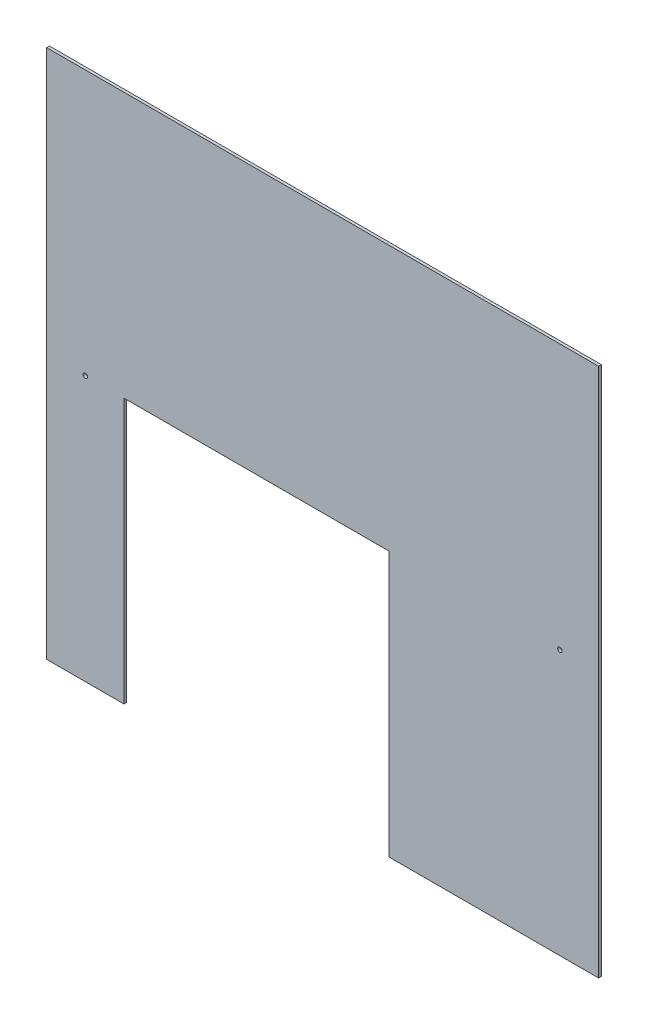
ISO-10303-21;
HEADER;
FILE_DESCRIPTION(('STEP AP214'),'2;1');
FILE_NAME('part.step','',(''),(''),'','','');
FILE_SCHEMA(('AUTOMOTIVE_DESIGN { 1 0 10303 214 1 1 1 1 }'));
ENDSEC;
DATA;
#1=APPLICATION_CONTEXT('core data for automotive mechanical design processes');
#2=APPLICATION_PROTOCOL_DEFINITION('international standard','automotive_design',2000,#1);
#3=PRODUCT_CONTEXT('',#1,'mechanical');
#4=PRODUCT('Part','Part','',(#3));
#5=PRODUCT_RELATED_PRODUCT_CATEGORY('part','',(#4));
#6=PRODUCT_DEFINITION_FORMATION('','',#4);
#7=PRODUCT_DEFINITION_CONTEXT('part definition',#1,'design');
#8=PRODUCT_DEFINITION('design','',#6,#7);
#9=PRODUCT_DEFINITION_SHAPE('','',#8);
#10=(LENGTH_UNIT() NAMED_UNIT(*) SI_UNIT(.MILLI.,.METRE.));
#11=(NAMED_UNIT(*) PLANE_ANGLE_UNIT() SI_UNIT($,.RADIAN.));
#12=(NAMED_UNIT(*) SI_UNIT($,.STERADIAN.) SOLID_ANGLE_UNIT());
#13=UNCERTAINTY_MEASURE_WITH_UNIT(LENGTH_MEASURE(1.E-05),#10,'distance_accuracy_value','');
#14=(GEOMETRIC_REPRESENTATION_CONTEXT(3) GLOBAL_UNCERTAINTY_ASSIGNED_CONTEXT((#13)) GLOBAL_UNIT_ASSIGNED_CONTEXT((#10,
#11,#12)) REPRESENTATION_CONTEXT('',''));
#15=CARTESIAN_POINT('',(0.,0.,0.));
#16=DIRECTION('',(0.,0.,1.));
#17=DIRECTION('',(1.,0.,0.));
#18=AXIS2_PLACEMENT_3D('',#15,#16,#17);
#19=CARTESIAN_POINT('',(-630.182303707183,-173.201114206128,3.175));
#20=DIRECTION('',(1.,0.,0.));
#21=DIRECTION('',(0.,0.,-1.));
#22=AXIS2_PLACEMENT_3D('',#19,#20,#21);
#23=PLANE('',#22);
#24=DIRECTION('',(0.,-1.,0.));
#25=VECTOR('',#24,1.);
#26=CARTESIAN_POINT('',(-630.182303707183,-173.201114206128,0.));
#27=LINE('',#26,#25);
#28=CARTESIAN_POINT('',(-630.182303707183,436.398885793872,0.));
#29=VERTEX_POINT('',#28);
#30=CARTESIAN_POINT('',(-630.182303707183,-173.201114206128,0.));
#31=VERTEX_POINT('',#30);
#32=EDGE_CURVE('E134',#29,#31,#27,.T.);
#33=ORIENTED_EDGE('',*,*,#32,.T.);
#34=DIRECTION('',(0.,0.,-1.));
#35=VECTOR('',#34,1.);
#36=CARTESIAN_POINT('',(-630.182303707183,-173.201114206128,3.175));
#37=LINE('',#36,#35);
#38=CARTESIAN_POINT('',(-630.182303707183,-173.201114206128,3.175));
#39=VERTEX_POINT('',#38);
#40=EDGE_CURVE('E11',#39,#31,#37,.T.);
#41=ORIENTED_EDGE('',*,*,#40,.F.);
#42=DIRECTION('',(0.,-1.,0.));
#43=VECTOR('',#42,1.);
#44=CARTESIAN_POINT('',(-630.182303707183,-173.201114206128,3.175));
#45=LINE('',#44,#43);
#46=CARTESIAN_POINT('',(-630.182303707183,436.398885793872,3.175));
#47=VERTEX_POINT('',#46);
#48=EDGE_CURVE('E149',#47,#39,#45,.T.);
#49=ORIENTED_EDGE('',*,*,#48,.F.);
#50=DIRECTION('',(0.,0.,-1.));
#51=VECTOR('',#50,1.);
#52=CARTESIAN_POINT('',(-630.182303707183,436.398885793872,3.175));
#53=LINE('',#52,#51);
#54=EDGE_CURVE('E130',#47,#29,#53,.T.);
#55=ORIENTED_EDGE('',*,*,#54,.T.);
#56=EDGE_LOOP('',(#33,#41,#49,#55));
#57=FACE_BOUND('',#56,.T.);
#58=ADVANCED_FACE('F38',(#57),#23,.F.);
#59=CARTESIAN_POINT('',(-630.182303707183,-173.201114206128,3.175));
#60=DIRECTION('',(0.,1.,0.));
#61=DIRECTION('',(0.,0.,1.));
#62=AXIS2_PLACEMENT_3D('',#59,#60,#61);
#63=PLANE('',#62);
#64=DIRECTION('',(1.,0.,0.));
#65=VECTOR('',#64,1.);
#66=CARTESIAN_POINT('',(-630.182303707183,-173.201114206128,0.));
#67=LINE('',#66,#65);
#68=CARTESIAN_POINT('',(-541.282303707183,-173.201114206128,0.));
#69=VERTEX_POINT('',#68);
#70=EDGE_CURVE('E137',#31,#69,#67,.T.);
#71=ORIENTED_EDGE('',*,*,#70,.T.);
#72=DIRECTION('',(0.,0.,-1.));
#73=VECTOR('',#72,1.);
#74=CARTESIAN_POINT('',(-541.282303707183,-173.201114206128,3.175));
#75=LINE('',#74,#73);
#76=CARTESIAN_POINT('',(-541.282303707183,-173.201114206128,3.175));
#77=VERTEX_POINT('',#76);
#78=EDGE_CURVE('E46',#77,#69,#75,.T.);
#79=ORIENTED_EDGE('',*,*,#78,.F.);
#80=DIRECTION('',(1.,0.,0.));
#81=VECTOR('',#80,1.);
#82=CARTESIAN_POINT('',(-630.182303707183,-173.201114206128,3.175));
#83=LINE('',#82,#81);
#84=EDGE_CURVE('E97',#39,#77,#83,.T.);
#85=ORIENTED_EDGE('',*,*,#84,.F.);
#86=ORIENTED_EDGE('',*,*,#40,.T.);
#87=EDGE_LOOP('',(#71,#79,#85,#86));
#88=FACE_BOUND('',#87,.T.);
#89=ADVANCED_FACE('F219',(#88),#63,.F.);
#90=CARTESIAN_POINT('',(-541.282303707183,-173.201114206128,3.175));
#91=DIRECTION('',(-1.,0.,0.));
#92=DIRECTION('',(0.,0.,1.));
#93=AXIS2_PLACEMENT_3D('',#90,#91,#92);
#94=PLANE('',#93);
#95=DIRECTION('',(0.,1.,0.));
#96=VECTOR('',#95,1.);
#97=CARTESIAN_POINT('',(-541.282303707183,-173.201114206128,0.));
#98=LINE('',#97,#96);
#99=CARTESIAN_POINT('',(-541.282303707183,131.598885793872,0.));
#100=VERTEX_POINT('',#99);
#101=EDGE_CURVE('E140',#69,#100,#98,.T.);
#102=ORIENTED_EDGE('',*,*,#101,.T.);
#103=DIRECTION('',(0.,0.,-1.));
#104=VECTOR('',#103,1.);
#105=CARTESIAN_POINT('',(-541.282303707183,131.598885793872,3.175));
#106=LINE('',#105,#104);
#107=CARTESIAN_POINT('',(-541.282303707183,131.598885793872,3.175));
#108=VERTEX_POINT('',#107);
#109=EDGE_CURVE('E156',#108,#100,#106,.T.);
#110=ORIENTED_EDGE('',*,*,#109,.F.);
#111=DIRECTION('',(0.,1.,0.));
#112=VECTOR('',#111,1.);
#113=CARTESIAN_POINT('',(-541.282303707183,-173.201114206128,3.175));
#114=LINE('',#113,#112);
#115=EDGE_CURVE('E164',#77,#108,#114,.T.);
#116=ORIENTED_EDGE('',*,*,#115,.F.);
#117=ORIENTED_EDGE('',*,*,#78,.T.);
#118=EDGE_LOOP('',(#102,#110,#116,#117));
#119=FACE_BOUND('',#118,.T.);
#120=ADVANCED_FACE('F162',(#119),#94,.F.);
#121=CARTESIAN_POINT('',(-541.282303707183,131.598885793872,3.175));
#122=DIRECTION('',(0.,1.,0.));
#123=DIRECTION('',(0.,0.,1.));
#124=AXIS2_PLACEMENT_3D('',#121,#122,#123);
#125=PLANE('',#124);
#126=DIRECTION('',(1.,0.,0.));
#127=VECTOR('',#126,1.);
#128=CARTESIAN_POINT('',(-541.282303707183,131.598885793872,0.));
#129=LINE('',#128,#127);
#130=CARTESIAN_POINT('',(-236.482303707183,131.598885793872,0.));
#131=VERTEX_POINT('',#130);
#132=EDGE_CURVE('E142',#100,#131,#129,.T.);
#133=ORIENTED_EDGE('',*,*,#132,.T.);
#134=DIRECTION('',(0.,0.,-1.));
#135=VECTOR('',#134,1.);
#136=CARTESIAN_POINT('',(-236.482303707183,131.598885793872,3.175));
#137=LINE('',#136,#135);
#138=CARTESIAN_POINT('',(-236.482303707183,131.598885793872,3.175));
#139=VERTEX_POINT('',#138);
#140=EDGE_CURVE('E153',#139,#131,#137,.T.);
#141=ORIENTED_EDGE('',*,*,#140,.F.);
#142=DIRECTION('',(1.,0.,0.));
#143=VECTOR('',#142,1.);
#144=CARTESIAN_POINT('',(-541.282303707183,131.598885793872,3.175));
#145=LINE('',#144,#143);
#146=EDGE_CURVE('E176',#108,#139,#145,.T.);
#147=ORIENTED_EDGE('',*,*,#146,.F.);
#148=ORIENTED_EDGE('',*,*,#109,.T.);
#149=EDGE_LOOP('',(#133,#141,#147,#148));
#150=FACE_BOUND('',#149,.T.);
#151=ADVANCED_FACE('F172',(#150),#125,.F.);
#152=CARTESIAN_POINT('',(-236.482303707183,131.598885793872,3.175));
#153=DIRECTION('',(1.,0.,0.));
#154=DIRECTION('',(0.,1.,0.));
#155=AXIS2_PLACEMENT_3D('',#152,#153,#154);
#156=PLANE('',#155);
#157=DIRECTION('',(0.,-1.,0.));
#158=VECTOR('',#157,1.);
#159=CARTESIAN_POINT('',(-236.482303707183,131.598885793872,0.));
#160=LINE('',#159,#158);
#161=CARTESIAN_POINT('',(-236.482303707183,-173.201114206128,0.));
#162=VERTEX_POINT('',#161);
#163=EDGE_CURVE('E144',#131,#162,#160,.T.);
#164=ORIENTED_EDGE('',*,*,#163,.T.);
#165=DIRECTION('',(0.,0.,-1.));
#166=VECTOR('',#165,1.);
#167=CARTESIAN_POINT('',(-236.482303707183,-173.201114206128,3.175));
#168=LINE('',#167,#166);
#169=CARTESIAN_POINT('',(-236.482303707183,-173.201114206128,3.175));
#170=VERTEX_POINT('',#169);
#171=EDGE_CURVE('E125',#170,#162,#168,.T.);
#172=ORIENTED_EDGE('',*,*,#171,.F.);
#173=DIRECTION('',(0.,-1.,0.));
#174=VECTOR('',#173,1.);
#175=CARTESIAN_POINT('',(-236.482303707183,131.598885793872,3.175));
#176=LINE('',#175,#174);
#177=EDGE_CURVE('E116',#139,#170,#176,.T.);
#178=ORIENTED_EDGE('',*,*,#177,.F.);
#179=ORIENTED_EDGE('',*,*,#140,.T.);
#180=EDGE_LOOP('',(#164,#172,#178,#179));
#181=FACE_BOUND('',#180,.T.);
#182=ADVANCED_FACE('F175',(#181),#156,.F.);
#183=CARTESIAN_POINT('',(-236.482303707183,-173.201114206128,3.175));
#184=DIRECTION('',(0.,1.,0.));
#185=DIRECTION('',(0.,0.,1.));
#186=AXIS2_PLACEMENT_3D('',#183,#184,#185);
#187=PLANE('',#186);
#188=DIRECTION('',(1.,0.,0.));
#189=VECTOR('',#188,1.);
#190=CARTESIAN_POINT('',(-236.482303707183,-173.201114206128,0.));
#191=LINE('',#190,#189);
#192=CARTESIAN_POINT('',(4.81769629281692,-173.201114206128,0.));
#193=VERTEX_POINT('',#192);
#194=EDGE_CURVE('E124',#162,#193,#191,.T.);
#195=ORIENTED_EDGE('',*,*,#194,.T.);
#196=DIRECTION('',(0.,0.,-1.));
#197=VECTOR('',#196,1.);
#198=CARTESIAN_POINT('',(4.81769629281692,-173.201114206128,3.175));
#199=LINE('',#198,#197);
#200=CARTESIAN_POINT('',(4.81769629281692,-173.201114206128,3.175));
#201=VERTEX_POINT('',#200);
#202=EDGE_CURVE('E121',#201,#193,#199,.T.);
#203=ORIENTED_EDGE('',*,*,#202,.F.);
#204=DIRECTION('',(1.,0.,0.));
#205=VECTOR('',#204,1.);
#206=CARTESIAN_POINT('',(-236.482303707183,-173.201114206128,3.175));
#207=LINE('',#206,#205);
#208=EDGE_CURVE('E110',#170,#201,#207,.T.);
#209=ORIENTED_EDGE('',*,*,#208,.F.);
#210=ORIENTED_EDGE('',*,*,#171,.T.);
#211=EDGE_LOOP('',(#195,#203,#209,#210));
#212=FACE_BOUND('',#211,.T.);
#213=ADVANCED_FACE('F122',(#212),#187,.F.);
#214=CARTESIAN_POINT('',(4.8176962928167,436.398885793872,3.175));
#215=DIRECTION('',(-1.,0.,0.));
#216=DIRECTION('',(0.,-1.,0.));
#217=AXIS2_PLACEMENT_3D('',#214,#215,#216);
#218=PLANE('',#217);
#219=DIRECTION('',(0.,1.,0.));
#220=VECTOR('',#219,1.);
#221=CARTESIAN_POINT('',(4.8176962928167,436.398885793872,0.));
#222=LINE('',#221,#220);
#223=CARTESIAN_POINT('',(4.8176962928167,436.398885793872,0.));
#224=VERTEX_POINT('',#223);
#225=EDGE_CURVE('E83',#193,#224,#222,.T.);
#226=ORIENTED_EDGE('',*,*,#225,.T.);
#227=DIRECTION('',(0.,0.,-1.));
#228=VECTOR('',#227,1.);
#229=CARTESIAN_POINT('',(4.8176962928167,436.398885793872,3.175));
#230=LINE('',#229,#228);
#231=CARTESIAN_POINT('',(4.8176962928167,436.398885793872,3.175));
#232=VERTEX_POINT('',#231);
#233=EDGE_CURVE('E126',#232,#224,#230,.T.);
#234=ORIENTED_EDGE('',*,*,#233,.F.);
#235=DIRECTION('',(0.,1.,0.));
#236=VECTOR('',#235,1.);
#237=CARTESIAN_POINT('',(4.8176962928167,436.398885793872,3.175));
#238=LINE('',#237,#236);
#239=EDGE_CURVE('E114',#201,#232,#238,.T.);
#240=ORIENTED_EDGE('',*,*,#239,.F.);
#241=ORIENTED_EDGE('',*,*,#202,.T.);
#242=EDGE_LOOP('',(#226,#234,#240,#241));
#243=FACE_BOUND('',#242,.T.);
#244=ADVANCED_FACE('F128',(#243),#218,.F.);
#245=CARTESIAN_POINT('',(-630.182303707183,436.398885793872,3.175));
#246=DIRECTION('',(0.,-1.,0.));
#247=DIRECTION('',(0.,0.,-1.));
#248=AXIS2_PLACEMENT_3D('',#245,#246,#247);
#249=PLANE('',#248);
#250=DIRECTION('',(-1.,0.,0.));
#251=VECTOR('',#250,1.);
#252=CARTESIAN_POINT('',(-630.182303707183,436.398885793872,0.));
#253=LINE('',#252,#251);
#254=EDGE_CURVE('E89',#224,#29,#253,.T.);
#255=ORIENTED_EDGE('',*,*,#254,.T.);
#256=ORIENTED_EDGE('',*,*,#54,.F.);
#257=DIRECTION('',(-1.,0.,0.));
#258=VECTOR('',#257,1.);
#259=CARTESIAN_POINT('',(-630.182303707183,436.398885793872,3.175));
#260=LINE('',#259,#258);
#261=EDGE_CURVE('E54',#232,#47,#260,.T.);
#262=ORIENTED_EDGE('',*,*,#261,.F.);
#263=ORIENTED_EDGE('',*,*,#233,.T.);
#264=EDGE_LOOP('',(#255,#256,#262,#263));
#265=FACE_BOUND('',#264,.T.);
#266=ADVANCED_FACE('F205',(#265),#249,.F.);
#267=CARTESIAN_POINT('',(0.,0.,3.175));
#268=DIRECTION('',(0.,0.,-1.));
#269=DIRECTION('',(-1.,0.,0.));
#270=AXIS2_PLACEMENT_3D('',#267,#268,#269);
#271=PLANE('',#270);
#272=CARTESIAN_POINT('',(-585.732303707183,131.598885793872,3.175));
#273=DIRECTION('',(0.,0.,1.));
#274=DIRECTION('',(1.,0.,0.));
#275=AXIS2_PLACEMENT_3D('',#272,#273,#274);
#276=CIRCLE('',#275,2.57968750000002);
#277=CARTESIAN_POINT('',(-583.152616207183,131.598885793872,3.175));
#278=VERTEX_POINT('',#277);
#279=EDGE_CURVE('E188',#278,#278,#276,.T.);
#280=ORIENTED_EDGE('',*,*,#279,.F.);
#281=EDGE_LOOP('',(#280));
#282=FACE_BOUND('',#281,.T.);
#283=CARTESIAN_POINT('',(-39.6323037071831,131.598885793872,3.175));
#284=DIRECTION('',(0.,0.,1.));
#285=DIRECTION('',(1.,0.,0.));
#286=AXIS2_PLACEMENT_3D('',#283,#284,#285);
#287=CIRCLE('',#286,2.57968749999999);
#288=CARTESIAN_POINT('',(-37.0526162071831,131.598885793872,3.175));
#289=VERTEX_POINT('',#288);
#290=EDGE_CURVE('E182',#289,#289,#287,.T.);
#291=ORIENTED_EDGE('',*,*,#290,.F.);
#292=EDGE_LOOP('',(#291));
#293=FACE_BOUND('',#292,.T.);
#294=ORIENTED_EDGE('',*,*,#48,.T.);
#295=ORIENTED_EDGE('',*,*,#84,.T.);
#296=ORIENTED_EDGE('',*,*,#115,.T.);
#297=ORIENTED_EDGE('',*,*,#146,.T.);
#298=ORIENTED_EDGE('',*,*,#177,.T.);
#299=ORIENTED_EDGE('',*,*,#208,.T.);
#300=ORIENTED_EDGE('',*,*,#239,.T.);
#301=ORIENTED_EDGE('',*,*,#261,.T.);
#302=EDGE_LOOP('',(#294,#295,#296,#297,#298,#299,#300,#301));
#303=FACE_BOUND('',#302,.T.);
#304=ADVANCED_FACE('F112',(#282,#293,#303),#271,.F.);
#305=CARTESIAN_POINT('',(0.,0.,0.));
#306=DIRECTION('',(0.,0.,-1.));
#307=DIRECTION('',(-1.,0.,0.));
#308=AXIS2_PLACEMENT_3D('',#305,#306,#307);
#309=PLANE('',#308);
#310=CARTESIAN_POINT('',(-585.732303707183,131.598885793872,0.));
#311=DIRECTION('',(0.,0.,1.));
#312=DIRECTION('',(1.,0.,0.));
#313=AXIS2_PLACEMENT_3D('',#310,#311,#312);
#314=CIRCLE('',#313,2.57968750000002);
#315=CARTESIAN_POINT('',(-583.152616207183,131.598885793872,0.));
#316=VERTEX_POINT('',#315);
#317=EDGE_CURVE('E138',#316,#316,#314,.T.);
#318=ORIENTED_EDGE('',*,*,#317,.T.);
#319=EDGE_LOOP('',(#318));
#320=FACE_BOUND('',#319,.T.);
#321=CARTESIAN_POINT('',(-39.6323037071831,131.598885793872,0.));
#322=DIRECTION('',(0.,0.,1.));
#323=DIRECTION('',(1.,0.,0.));
#324=AXIS2_PLACEMENT_3D('',#321,#322,#323);
#325=CIRCLE('',#324,2.57968749999999);
#326=CARTESIAN_POINT('',(-37.0526162071831,131.598885793872,0.));
#327=VERTEX_POINT('',#326);
#328=EDGE_CURVE('E185',#327,#327,#325,.T.);
#329=ORIENTED_EDGE('',*,*,#328,.T.);
#330=EDGE_LOOP('',(#329));
#331=FACE_BOUND('',#330,.T.);
#332=ORIENTED_EDGE('',*,*,#32,.F.);
#333=ORIENTED_EDGE('',*,*,#254,.F.);
#334=ORIENTED_EDGE('',*,*,#225,.F.);
#335=ORIENTED_EDGE('',*,*,#194,.F.);
#336=ORIENTED_EDGE('',*,*,#163,.F.);
#337=ORIENTED_EDGE('',*,*,#132,.F.);
#338=ORIENTED_EDGE('',*,*,#101,.F.);
#339=ORIENTED_EDGE('',*,*,#70,.F.);
#340=EDGE_LOOP('',(#332,#333,#334,#335,#336,#337,#338,#339));
#341=FACE_BOUND('',#340,.T.);
#342=ADVANCED_FACE('F168',(#320,#331,#341),#309,.T.);
#343=CARTESIAN_POINT('',(-39.6323037071831,131.598885793872,0.));
#344=DIRECTION('',(0.,0.,1.));
#345=DIRECTION('',(1.,0.,0.));
#346=AXIS2_PLACEMENT_3D('',#343,#344,#345);
#347=CYLINDRICAL_SURFACE('',#346,2.57968749999999);
#348=ORIENTED_EDGE('',*,*,#328,.F.);
#349=EDGE_LOOP('',(#348));
#350=FACE_BOUND('',#349,.T.);
#351=ORIENTED_EDGE('',*,*,#290,.T.);
#352=EDGE_LOOP('',(#351));
#353=FACE_BOUND('',#352,.T.);
#354=ADVANCED_FACE('F199',(#350,#353),#347,.F.);
#355=CARTESIAN_POINT('',(-585.732303707183,131.598885793872,0.));
#356=DIRECTION('',(0.,0.,1.));
#357=DIRECTION('',(1.,0.,0.));
#358=AXIS2_PLACEMENT_3D('',#355,#356,#357);
#359=CYLINDRICAL_SURFACE('',#358,2.57968750000002);
#360=ORIENTED_EDGE('',*,*,#317,.F.);
#361=EDGE_LOOP('',(#360));
#362=FACE_BOUND('',#361,.T.);
#363=ORIENTED_EDGE('',*,*,#279,.T.);
#364=EDGE_LOOP('',(#363));
#365=FACE_BOUND('',#364,.T.);
#366=ADVANCED_FACE('F196',(#362,#365),#359,.F.);
#367=CLOSED_SHELL('',(#58,#89,#120,#151,#182,#213,#244,#266,#304,#342,#354,#366));
#368=MANIFOLD_SOLID_BREP('B2',#367);
#369=ADVANCED_BREP_SHAPE_REPRESENTATION('',(#18,#368),#14);
#370=SHAPE_DEFINITION_REPRESENTATION(#9,#369);
ENDSEC;
END-ISO-10303-21;
